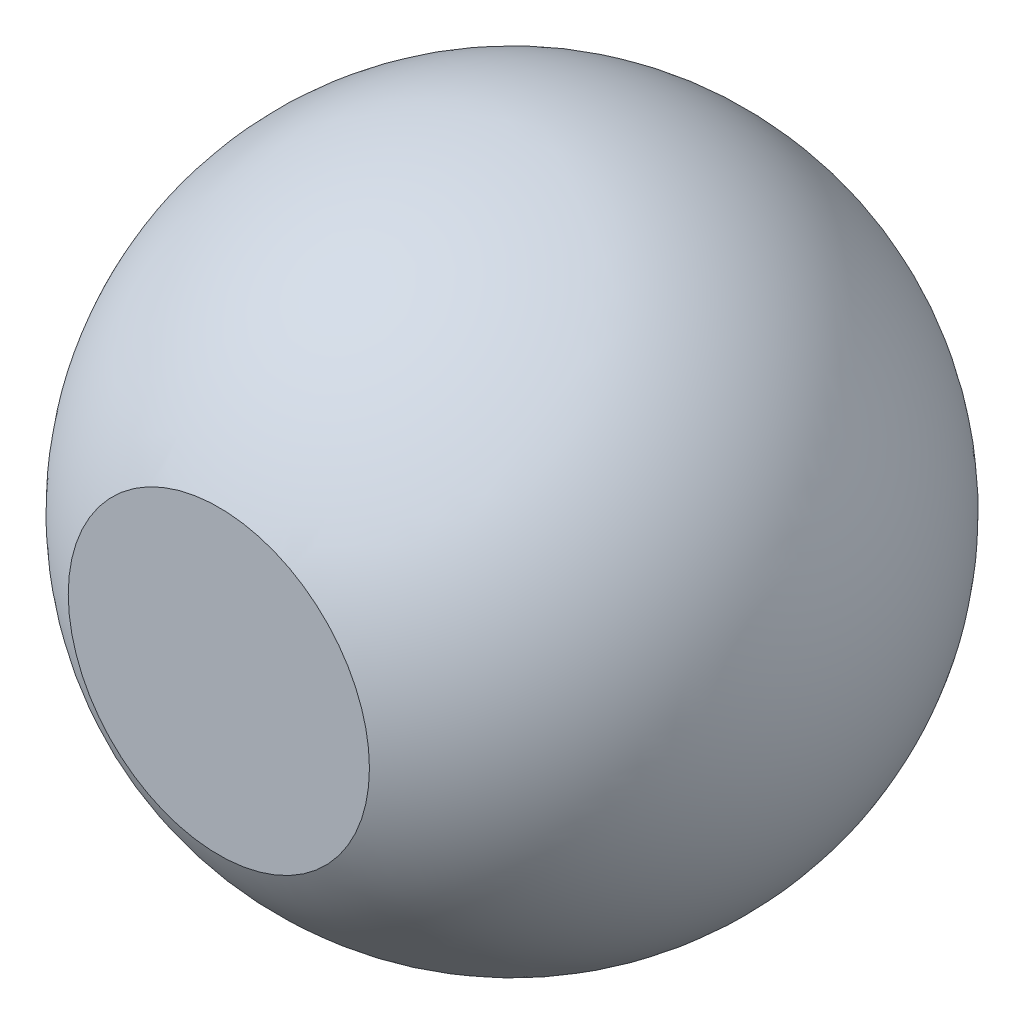
ISO-10303-21;
HEADER;
FILE_DESCRIPTION(('STEP AP214'),'2;1');
FILE_NAME('part.step','',(''),(''),'','','');
FILE_SCHEMA(('AUTOMOTIVE_DESIGN { 1 0 10303 214 1 1 1 1 }'));
ENDSEC;
DATA;
#1=APPLICATION_CONTEXT('core data for automotive mechanical design processes');
#2=APPLICATION_PROTOCOL_DEFINITION('international standard','automotive_design',2000,#1);
#3=PRODUCT_CONTEXT('',#1,'mechanical');
#4=PRODUCT('Part','Part','',(#3));
#5=PRODUCT_RELATED_PRODUCT_CATEGORY('part','',(#4));
#6=PRODUCT_DEFINITION_FORMATION('','',#4);
#7=PRODUCT_DEFINITION_CONTEXT('part definition',#1,'design');
#8=PRODUCT_DEFINITION('design','',#6,#7);
#9=PRODUCT_DEFINITION_SHAPE('','',#8);
#10=(LENGTH_UNIT() NAMED_UNIT(*) SI_UNIT(.MILLI.,.METRE.));
#11=(NAMED_UNIT(*) PLANE_ANGLE_UNIT() SI_UNIT($,.RADIAN.));
#12=(NAMED_UNIT(*) SI_UNIT($,.STERADIAN.) SOLID_ANGLE_UNIT());
#13=UNCERTAINTY_MEASURE_WITH_UNIT(LENGTH_MEASURE(1.E-05),#10,'distance_accuracy_value','');
#14=(GEOMETRIC_REPRESENTATION_CONTEXT(3) GLOBAL_UNCERTAINTY_ASSIGNED_CONTEXT((#13)) GLOBAL_UNIT_ASSIGNED_CONTEXT((#10,
#11,#12)) REPRESENTATION_CONTEXT('',''));
#15=CARTESIAN_POINT('',(0.,0.,0.));
#16=DIRECTION('',(0.,0.,1.));
#17=DIRECTION('',(1.,0.,0.));
#18=AXIS2_PLACEMENT_3D('',#15,#16,#17);
#19=CARTESIAN_POINT('',(0.,0.,0.));
#20=DIRECTION('',(-1.,0.,0.));
#21=DIRECTION('',(0.,1.,0.));
#22=AXIS2_PLACEMENT_3D('',#19,#20,#21);
#23=SPHERICAL_SURFACE('',#22,4.5);
#24=CARTESIAN_POINT('',(0.,0.,4.00282017151991));
#25=DIRECTION('',(0.,0.,1.));
#26=DIRECTION('',(1.,0.,0.));
#27=AXIS2_PLACEMENT_3D('',#24,#25,#26);
#28=CIRCLE('',#27,2.05607166083123);
#29=CARTESIAN_POINT('',(2.05607166083123,0.,4.00282017151991));
#30=VERTEX_POINT('',#29);
#31=EDGE_CURVE('E10',#30,#30,#28,.T.);
#32=ORIENTED_EDGE('',*,*,#31,.F.);
#33=EDGE_LOOP('',(#32));
#34=FACE_BOUND('',#33,.T.);
#35=CARTESIAN_POINT('',(0.,-4.01625245397468,0.));
#36=DIRECTION('',(0.,-1.,0.));
#37=DIRECTION('',(0.,0.,-1.));
#38=AXIS2_PLACEMENT_3D('',#35,#36,#37);
#39=CIRCLE('',#38,2.02970840909288);
#40=CARTESIAN_POINT('',(0.,-4.01625245397468,-2.02970840909288));
#41=VERTEX_POINT('',#40);
#42=EDGE_CURVE('E35',#41,#41,#39,.T.);
#43=ORIENTED_EDGE('',*,*,#42,.F.);
#44=EDGE_LOOP('',(#43));
#45=FACE_BOUND('',#44,.T.);
#46=ADVANCED_FACE('F32',(#34,#45),#23,.T.);
#47=CARTESIAN_POINT('',(10.,2.25662345240049,4.00282017151991));
#48=DIRECTION('',(0.,0.,1.));
#49=DIRECTION('',(1.,0.,0.));
#50=AXIS2_PLACEMENT_3D('',#47,#48,#49);
#51=PLANE('',#50);
#52=ORIENTED_EDGE('',*,*,#31,.T.);
#53=EDGE_LOOP('',(#52));
#54=FACE_BOUND('',#53,.T.);
#55=ADVANCED_FACE('F47',(#54),#51,.T.);
#56=CARTESIAN_POINT('',(10.,-4.01625245397468,-2.21632660503619));
#57=DIRECTION('',(0.,-1.,0.));
#58=DIRECTION('',(0.,0.,-1.));
#59=AXIS2_PLACEMENT_3D('',#56,#57,#58);
#60=PLANE('',#59);
#61=ORIENTED_EDGE('',*,*,#42,.T.);
#62=EDGE_LOOP('',(#61));
#63=FACE_BOUND('',#62,.T.);
#64=ADVANCED_FACE('F44',(#63),#60,.T.);
#65=CLOSED_SHELL('',(#46,#55,#64));
#66=MANIFOLD_SOLID_BREP('B2',#65);
#67=ADVANCED_BREP_SHAPE_REPRESENTATION('',(#18,#66),#14);
#68=SHAPE_DEFINITION_REPRESENTATION(#9,#67);
ENDSEC;
END-ISO-10303-21;
